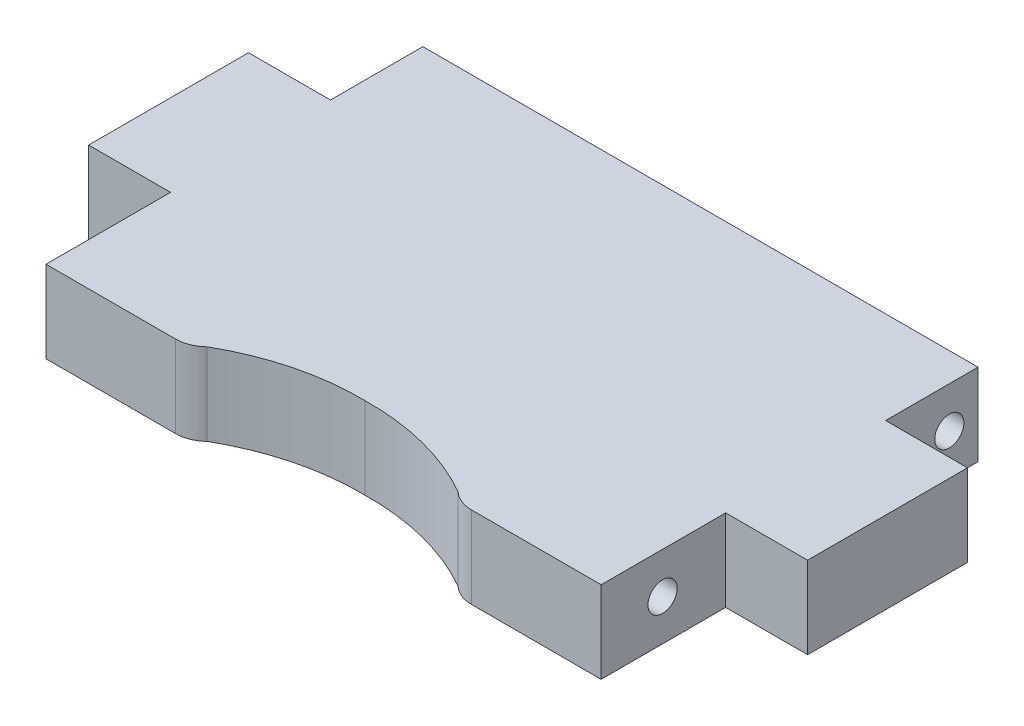
ISO-10303-21;
HEADER;
FILE_DESCRIPTION(('STEP AP214'),'2;1');
FILE_NAME('part.step','',(''),(''),'','','');
FILE_SCHEMA(('AUTOMOTIVE_DESIGN { 1 0 10303 214 1 1 1 1 }'));
ENDSEC;
DATA;
#1=APPLICATION_CONTEXT('core data for automotive mechanical design processes');
#2=APPLICATION_PROTOCOL_DEFINITION('international standard','automotive_design',2000,#1);
#3=PRODUCT_CONTEXT('',#1,'mechanical');
#4=PRODUCT('Part','Part','',(#3));
#5=PRODUCT_RELATED_PRODUCT_CATEGORY('part','',(#4));
#6=PRODUCT_DEFINITION_FORMATION('','',#4);
#7=PRODUCT_DEFINITION_CONTEXT('part definition',#1,'design');
#8=PRODUCT_DEFINITION('design','',#6,#7);
#9=PRODUCT_DEFINITION_SHAPE('','',#8);
#10=(LENGTH_UNIT() NAMED_UNIT(*) SI_UNIT(.MILLI.,.METRE.));
#11=(NAMED_UNIT(*) PLANE_ANGLE_UNIT() SI_UNIT($,.RADIAN.));
#12=(NAMED_UNIT(*) SI_UNIT($,.STERADIAN.) SOLID_ANGLE_UNIT());
#13=UNCERTAINTY_MEASURE_WITH_UNIT(LENGTH_MEASURE(1.E-05),#10,'distance_accuracy_value','');
#14=(GEOMETRIC_REPRESENTATION_CONTEXT(3) GLOBAL_UNCERTAINTY_ASSIGNED_CONTEXT((#13)) GLOBAL_UNIT_ASSIGNED_CONTEXT((#10,
#11,#12)) REPRESENTATION_CONTEXT('',''));
#15=CARTESIAN_POINT('',(0.,0.,0.));
#16=DIRECTION('',(0.,0.,1.));
#17=DIRECTION('',(1.,0.,0.));
#18=AXIS2_PLACEMENT_3D('',#15,#16,#17);
#19=CARTESIAN_POINT('',(21.5138,6.35,6.22300000000001));
#20=DIRECTION('',(-1.,0.,0.));
#21=DIRECTION('',(0.,0.,1.));
#22=AXIS2_PLACEMENT_3D('',#19,#20,#21);
#23=PLANE('',#22);
#24=DIRECTION('',(0.,0.,-1.));
#25=VECTOR('',#24,1.);
#26=CARTESIAN_POINT('',(21.5138,0.,6.22300000000001));
#27=LINE('',#26,#25);
#28=CARTESIAN_POINT('',(21.5138,0.,15.875));
#29=VERTEX_POINT('',#28);
#30=CARTESIAN_POINT('',(21.5138,0.,6.22300000000001));
#31=VERTEX_POINT('',#30);
#32=EDGE_CURVE('E247',#29,#31,#27,.T.);
#33=ORIENTED_EDGE('',*,*,#32,.T.);
#34=DIRECTION('',(0.,-1.,0.));
#35=VECTOR('',#34,1.);
#36=CARTESIAN_POINT('',(21.5138,6.35,6.22300000000001));
#37=LINE('',#36,#35);
#38=CARTESIAN_POINT('',(21.5138,6.35,6.22300000000001));
#39=VERTEX_POINT('',#38);
#40=EDGE_CURVE('E186',#39,#31,#37,.T.);
#41=ORIENTED_EDGE('',*,*,#40,.F.);
#42=DIRECTION('',(0.,0.,-1.));
#43=VECTOR('',#42,1.);
#44=CARTESIAN_POINT('',(21.5138,6.35,6.22300000000001));
#45=LINE('',#44,#43);
#46=CARTESIAN_POINT('',(21.5138,6.35,15.875));
#47=VERTEX_POINT('',#46);
#48=EDGE_CURVE('E276',#47,#39,#45,.T.);
#49=ORIENTED_EDGE('',*,*,#48,.F.);
#50=DIRECTION('',(0.,-1.,0.));
#51=VECTOR('',#50,1.);
#52=CARTESIAN_POINT('',(21.5138,6.35,15.875));
#53=LINE('',#52,#51);
#54=EDGE_CURVE('E172',#47,#29,#53,.T.);
#55=ORIENTED_EDGE('',*,*,#54,.T.);
#56=EDGE_LOOP('',(#33,#41,#49,#55));
#57=FACE_BOUND('',#56,.T.);
#58=CARTESIAN_POINT('',(21.5138,3.175,11.1125));
#59=DIRECTION('',(-1.,0.,0.));
#60=DIRECTION('',(0.,0.,-1.));
#61=AXIS2_PLACEMENT_3D('',#58,#59,#60);
#62=CIRCLE('',#61,1.1303);
#63=CARTESIAN_POINT('',(21.5138,3.175,9.98220000000004));
#64=VERTEX_POINT('',#63);
#65=EDGE_CURVE('E297',#64,#64,#62,.T.);
#66=ORIENTED_EDGE('',*,*,#65,.T.);
#67=EDGE_LOOP('',(#66));
#68=FACE_BOUND('',#67,.T.);
#69=ADVANCED_FACE('F33',(#57,#68),#23,.F.);
#70=CARTESIAN_POINT('',(21.5138,6.35,-13.3349999999999));
#71=DIRECTION('',(-1.,0.,0.));
#72=DIRECTION('',(0.,0.,1.));
#73=AXIS2_PLACEMENT_3D('',#70,#71,#72);
#74=PLANE('',#73);
#75=DIRECTION('',(0.,0.,-1.));
#76=VECTOR('',#75,1.);
#77=CARTESIAN_POINT('',(21.5138,0.,-13.3349999999999));
#78=LINE('',#77,#76);
#79=CARTESIAN_POINT('',(21.5138,0.,-6.17219999999999));
#80=VERTEX_POINT('',#79);
#81=CARTESIAN_POINT('',(21.5138,0.,-13.3349999999999));
#82=VERTEX_POINT('',#81);
#83=EDGE_CURVE('E239',#80,#82,#78,.T.);
#84=ORIENTED_EDGE('',*,*,#83,.T.);
#85=DIRECTION('',(0.,-1.,0.));
#86=VECTOR('',#85,1.);
#87=CARTESIAN_POINT('',(21.5138,6.35,-13.3349999999999));
#88=LINE('',#87,#86);
#89=CARTESIAN_POINT('',(21.5138,6.35,-13.3349999999999));
#90=VERTEX_POINT('',#89);
#91=EDGE_CURVE('E198',#90,#82,#88,.T.);
#92=ORIENTED_EDGE('',*,*,#91,.F.);
#93=DIRECTION('',(0.,0.,-1.));
#94=VECTOR('',#93,1.);
#95=CARTESIAN_POINT('',(21.5138,6.35,-13.3349999999999));
#96=LINE('',#95,#94);
#97=CARTESIAN_POINT('',(21.5138,6.35,-6.17219999999999));
#98=VERTEX_POINT('',#97);
#99=EDGE_CURVE('E268',#98,#90,#96,.T.);
#100=ORIENTED_EDGE('',*,*,#99,.F.);
#101=DIRECTION('',(0.,-1.,0.));
#102=VECTOR('',#101,1.);
#103=CARTESIAN_POINT('',(21.5138,6.35,-6.17219999999999));
#104=LINE('',#103,#102);
#105=EDGE_CURVE('E195',#98,#80,#104,.T.);
#106=ORIENTED_EDGE('',*,*,#105,.T.);
#107=EDGE_LOOP('',(#84,#92,#100,#106));
#108=FACE_BOUND('',#107,.T.);
#109=CARTESIAN_POINT('',(21.5138,3.175,-11.1125));
#110=DIRECTION('',(-1.,0.,0.));
#111=DIRECTION('',(0.,0.,1.));
#112=AXIS2_PLACEMENT_3D('',#109,#110,#111);
#113=CIRCLE('',#112,1.1303);
#114=CARTESIAN_POINT('',(21.5138,3.175,-9.9822));
#115=VERTEX_POINT('',#114);
#116=EDGE_CURVE('E291',#115,#115,#113,.T.);
#117=ORIENTED_EDGE('',*,*,#116,.T.);
#118=EDGE_LOOP('',(#117));
#119=FACE_BOUND('',#118,.T.);
#120=ADVANCED_FACE('F316',(#108,#119),#74,.F.);
#121=CARTESIAN_POINT('',(0.326891457855017,6.35,31.5256615416297));
#122=DIRECTION('',(0.,-1.,0.));
#123=DIRECTION('',(0.,0.,-1.));
#124=AXIS2_PLACEMENT_3D('',#121,#122,#123);
#125=CYLINDRICAL_SURFACE('',#124,18.8600533877145);
#126=CARTESIAN_POINT('',(0.326891457855017,0.,31.5256615416297));
#127=DIRECTION('',(0.,-1.,0.));
#128=DIRECTION('',(0.,0.,-1.));
#129=AXIS2_PLACEMENT_3D('',#126,#127,#128);
#130=CIRCLE('',#129,18.8600533877145);
#131=CARTESIAN_POINT('',(0.,0.,12.6684412861884));
#132=VERTEX_POINT('',#131);
#133=CARTESIAN_POINT('',(9.729950233897,0.,15.1768359128042));
#134=VERTEX_POINT('',#133);
#135=EDGE_CURVE('E169',#132,#134,#130,.T.);
#136=ORIENTED_EDGE('',*,*,#135,.T.);
#137=DIRECTION('',(0.,-1.,0.));
#138=VECTOR('',#137,1.);
#139=CARTESIAN_POINT('',(9.729950233897,6.35,15.1768359128042));
#140=LINE('',#139,#138);
#141=CARTESIAN_POINT('',(9.729950233897,6.35,15.1768359128042));
#142=VERTEX_POINT('',#141);
#143=EDGE_CURVE('E166',#142,#134,#140,.T.);
#144=ORIENTED_EDGE('',*,*,#143,.F.);
#145=CARTESIAN_POINT('',(0.326891457855017,6.35,31.5256615416297));
#146=DIRECTION('',(0.,-1.,0.));
#147=DIRECTION('',(0.,0.,-1.));
#148=AXIS2_PLACEMENT_3D('',#145,#146,#147);
#149=CIRCLE('',#148,18.8600533877145);
#150=CARTESIAN_POINT('',(0.,6.35,12.6684412861884));
#151=VERTEX_POINT('',#150);
#152=EDGE_CURVE('E151',#151,#142,#149,.T.);
#153=ORIENTED_EDGE('',*,*,#152,.F.);
#154=DIRECTION('',(0.,-1.,0.));
#155=VECTOR('',#154,1.);
#156=CARTESIAN_POINT('',(0.,6.35,12.6684412861884));
#157=LINE('',#156,#155);
#158=EDGE_CURVE('E222',#151,#132,#157,.T.);
#159=ORIENTED_EDGE('',*,*,#158,.T.);
#160=EDGE_LOOP('',(#136,#144,#153,#159));
#161=FACE_BOUND('',#160,.T.);
#162=ADVANCED_FACE('F167',(#161),#125,.F.);
#163=CARTESIAN_POINT('',(9.729950233897,6.35,15.875));
#164=DIRECTION('',(0.,0.,-1.));
#165=DIRECTION('',(-1.,0.,0.));
#166=AXIS2_PLACEMENT_3D('',#163,#164,#165);
#167=PLANE('',#166);
#168=DIRECTION('',(1.,0.,0.));
#169=VECTOR('',#168,1.);
#170=CARTESIAN_POINT('',(9.729950233897,6.35,15.875));
#171=LINE('',#170,#169);
#172=CARTESIAN_POINT('',(11.4790186917639,6.35,15.875));
#173=VERTEX_POINT('',#172);
#174=EDGE_CURVE('E161',#173,#47,#171,.T.);
#175=ORIENTED_EDGE('',*,*,#174,.F.);
#176=DIRECTION('',(0.,-1.,0.));
#177=VECTOR('',#176,1.);
#178=CARTESIAN_POINT('',(11.4790186917639,6.35,15.875));
#179=LINE('',#178,#177);
#180=CARTESIAN_POINT('',(11.4790186917639,0.,15.875));
#181=VERTEX_POINT('',#180);
#182=EDGE_CURVE('E171',#173,#181,#179,.T.);
#183=ORIENTED_EDGE('',*,*,#182,.T.);
#184=DIRECTION('',(1.,0.,0.));
#185=VECTOR('',#184,1.);
#186=CARTESIAN_POINT('',(9.729950233897,0.,15.875));
#187=LINE('',#186,#185);
#188=EDGE_CURVE('E249',#181,#29,#187,.T.);
#189=ORIENTED_EDGE('',*,*,#188,.T.);
#190=ORIENTED_EDGE('',*,*,#54,.F.);
#191=EDGE_LOOP('',(#175,#183,#189,#190));
#192=FACE_BOUND('',#191,.T.);
#193=ADVANCED_FACE('F329',(#192),#167,.F.);
#194=CARTESIAN_POINT('',(21.5138,6.35,6.22300000000001));
#195=DIRECTION('',(0.,0.,-1.));
#196=DIRECTION('',(-1.,0.,0.));
#197=AXIS2_PLACEMENT_3D('',#194,#195,#196);
#198=PLANE('',#197);
#199=DIRECTION('',(1.,0.,0.));
#200=VECTOR('',#199,1.);
#201=CARTESIAN_POINT('',(21.5138,0.,6.22300000000001));
#202=LINE('',#201,#200);
#203=CARTESIAN_POINT('',(27.8638,0.,6.22300000000001));
#204=VERTEX_POINT('',#203);
#205=EDGE_CURVE('E245',#31,#204,#202,.T.);
#206=ORIENTED_EDGE('',*,*,#205,.T.);
#207=DIRECTION('',(0.,-1.,0.));
#208=VECTOR('',#207,1.);
#209=CARTESIAN_POINT('',(27.8638,6.35,6.22300000000001));
#210=LINE('',#209,#208);
#211=CARTESIAN_POINT('',(27.8638,6.35,6.22300000000001));
#212=VERTEX_POINT('',#211);
#213=EDGE_CURVE('E189',#212,#204,#210,.T.);
#214=ORIENTED_EDGE('',*,*,#213,.F.);
#215=DIRECTION('',(1.,0.,0.));
#216=VECTOR('',#215,1.);
#217=CARTESIAN_POINT('',(21.5138,6.35,6.22300000000001));
#218=LINE('',#217,#216);
#219=EDGE_CURVE('E274',#39,#212,#218,.T.);
#220=ORIENTED_EDGE('',*,*,#219,.F.);
#221=ORIENTED_EDGE('',*,*,#40,.T.);
#222=EDGE_LOOP('',(#206,#214,#220,#221));
#223=FACE_BOUND('',#222,.T.);
#224=ADVANCED_FACE('F327',(#223),#198,.F.);
#225=CARTESIAN_POINT('',(27.8638,6.35,-6.17219999999999));
#226=DIRECTION('',(-1.,0.,0.));
#227=DIRECTION('',(0.,0.,1.));
#228=AXIS2_PLACEMENT_3D('',#225,#226,#227);
#229=PLANE('',#228);
#230=DIRECTION('',(0.,0.,-1.));
#231=VECTOR('',#230,1.);
#232=CARTESIAN_POINT('',(27.8638,0.,-6.17219999999999));
#233=LINE('',#232,#231);
#234=CARTESIAN_POINT('',(27.8638,0.,-6.17219999999999));
#235=VERTEX_POINT('',#234);
#236=EDGE_CURVE('E243',#204,#235,#233,.T.);
#237=ORIENTED_EDGE('',*,*,#236,.T.);
#238=DIRECTION('',(0.,-1.,0.));
#239=VECTOR('',#238,1.);
#240=CARTESIAN_POINT('',(27.8638,6.35,-6.17219999999999));
#241=LINE('',#240,#239);
#242=CARTESIAN_POINT('',(27.8638,6.35,-6.17219999999999));
#243=VERTEX_POINT('',#242);
#244=EDGE_CURVE('E192',#243,#235,#241,.T.);
#245=ORIENTED_EDGE('',*,*,#244,.F.);
#246=DIRECTION('',(0.,0.,-1.));
#247=VECTOR('',#246,1.);
#248=CARTESIAN_POINT('',(27.8638,6.35,-6.17219999999999));
#249=LINE('',#248,#247);
#250=EDGE_CURVE('E272',#212,#243,#249,.T.);
#251=ORIENTED_EDGE('',*,*,#250,.F.);
#252=ORIENTED_EDGE('',*,*,#213,.T.);
#253=EDGE_LOOP('',(#237,#245,#251,#252));
#254=FACE_BOUND('',#253,.T.);
#255=ADVANCED_FACE('F349',(#254),#229,.F.);
#256=CARTESIAN_POINT('',(21.5138,6.35,-6.17219999999999));
#257=DIRECTION('',(0.,0.,1.));
#258=DIRECTION('',(1.,0.,0.));
#259=AXIS2_PLACEMENT_3D('',#256,#257,#258);
#260=PLANE('',#259);
#261=DIRECTION('',(-1.,0.,0.));
#262=VECTOR('',#261,1.);
#263=CARTESIAN_POINT('',(21.5138,0.,-6.17219999999999));
#264=LINE('',#263,#262);
#265=EDGE_CURVE('E241',#235,#80,#264,.T.);
#266=ORIENTED_EDGE('',*,*,#265,.T.);
#267=ORIENTED_EDGE('',*,*,#105,.F.);
#268=DIRECTION('',(-1.,0.,0.));
#269=VECTOR('',#268,1.);
#270=CARTESIAN_POINT('',(21.5138,6.35,-6.17219999999999));
#271=LINE('',#270,#269);
#272=EDGE_CURVE('E270',#243,#98,#271,.T.);
#273=ORIENTED_EDGE('',*,*,#272,.F.);
#274=ORIENTED_EDGE('',*,*,#244,.T.);
#275=EDGE_LOOP('',(#266,#267,#273,#274));
#276=FACE_BOUND('',#275,.T.);
#277=ADVANCED_FACE('F356',(#276),#260,.F.);
#278=CARTESIAN_POINT('',(-21.5138,6.35,-13.3349999999999));
#279=DIRECTION('',(0.,0.,1.));
#280=DIRECTION('',(1.,0.,0.));
#281=AXIS2_PLACEMENT_3D('',#278,#279,#280);
#282=PLANE('',#281);
#283=DIRECTION('',(-1.,0.,0.));
#284=VECTOR('',#283,1.);
#285=CARTESIAN_POINT('',(-21.5138,0.,-13.3349999999999));
#286=LINE('',#285,#284);
#287=CARTESIAN_POINT('',(-21.5138,0.,-13.3349999999999));
#288=VERTEX_POINT('',#287);
#289=EDGE_CURVE('E237',#82,#288,#286,.T.);
#290=ORIENTED_EDGE('',*,*,#289,.T.);
#291=DIRECTION('',(0.,-1.,0.));
#292=VECTOR('',#291,1.);
#293=CARTESIAN_POINT('',(-21.5138,6.35,-13.3349999999999));
#294=LINE('',#293,#292);
#295=CARTESIAN_POINT('',(-21.5138,6.35,-13.3349999999999));
#296=VERTEX_POINT('',#295);
#297=EDGE_CURVE('E201',#296,#288,#294,.T.);
#298=ORIENTED_EDGE('',*,*,#297,.F.);
#299=DIRECTION('',(-1.,0.,0.));
#300=VECTOR('',#299,1.);
#301=CARTESIAN_POINT('',(-21.5138,6.35,-13.3349999999999));
#302=LINE('',#301,#300);
#303=EDGE_CURVE('E266',#90,#296,#302,.T.);
#304=ORIENTED_EDGE('',*,*,#303,.F.);
#305=ORIENTED_EDGE('',*,*,#91,.T.);
#306=EDGE_LOOP('',(#290,#298,#304,#305));
#307=FACE_BOUND('',#306,.T.);
#308=ADVANCED_FACE('F363',(#307),#282,.F.);
#309=CARTESIAN_POINT('',(-21.5138,6.35,-13.3349999999999));
#310=DIRECTION('',(1.,0.,0.));
#311=DIRECTION('',(0.,0.,-1.));
#312=AXIS2_PLACEMENT_3D('',#309,#310,#311);
#313=PLANE('',#312);
#314=CARTESIAN_POINT('',(-21.5138,3.175,-11.1125));
#315=DIRECTION('',(-1.,0.,0.));
#316=DIRECTION('',(0.,0.,1.));
#317=AXIS2_PLACEMENT_3D('',#314,#315,#316);
#318=CIRCLE('',#317,1.1303);
#319=CARTESIAN_POINT('',(-21.5138,3.175,-9.9822));
#320=VERTEX_POINT('',#319);
#321=EDGE_CURVE('E279',#320,#320,#318,.T.);
#322=ORIENTED_EDGE('',*,*,#321,.F.);
#323=EDGE_LOOP('',(#322));
#324=FACE_BOUND('',#323,.T.);
#325=DIRECTION('',(0.,0.,1.));
#326=VECTOR('',#325,1.);
#327=CARTESIAN_POINT('',(-21.5138,0.,-13.3349999999999));
#328=LINE('',#327,#326);
#329=CARTESIAN_POINT('',(-21.5138,0.,-6.17219999999996));
#330=VERTEX_POINT('',#329);
#331=EDGE_CURVE('E235',#288,#330,#328,.T.);
#332=ORIENTED_EDGE('',*,*,#331,.T.);
#333=DIRECTION('',(0.,-1.,0.));
#334=VECTOR('',#333,1.);
#335=CARTESIAN_POINT('',(-21.5138,6.35,-6.17219999999996));
#336=LINE('',#335,#334);
#337=CARTESIAN_POINT('',(-21.5138,6.35,-6.17219999999996));
#338=VERTEX_POINT('',#337);
#339=EDGE_CURVE('E204',#338,#330,#336,.T.);
#340=ORIENTED_EDGE('',*,*,#339,.F.);
#341=DIRECTION('',(0.,0.,1.));
#342=VECTOR('',#341,1.);
#343=CARTESIAN_POINT('',(-21.5138,6.35,-13.3349999999999));
#344=LINE('',#343,#342);
#345=EDGE_CURVE('E264',#296,#338,#344,.T.);
#346=ORIENTED_EDGE('',*,*,#345,.F.);
#347=ORIENTED_EDGE('',*,*,#297,.T.);
#348=EDGE_LOOP('',(#332,#340,#346,#347));
#349=FACE_BOUND('',#348,.T.);
#350=ADVANCED_FACE('F371',(#324,#349),#313,.F.);
#351=CARTESIAN_POINT('',(-21.5138,6.35,-6.17219999999996));
#352=DIRECTION('',(0.,0.,1.));
#353=DIRECTION('',(1.,0.,0.));
#354=AXIS2_PLACEMENT_3D('',#351,#352,#353);
#355=PLANE('',#354);
#356=DIRECTION('',(-1.,0.,0.));
#357=VECTOR('',#356,1.);
#358=CARTESIAN_POINT('',(-21.5138,0.,-6.17219999999996));
#359=LINE('',#358,#357);
#360=CARTESIAN_POINT('',(-27.8638,0.,-6.17219999999996));
#361=VERTEX_POINT('',#360);
#362=EDGE_CURVE('E233',#330,#361,#359,.T.);
#363=ORIENTED_EDGE('',*,*,#362,.T.);
#364=DIRECTION('',(0.,-1.,0.));
#365=VECTOR('',#364,1.);
#366=CARTESIAN_POINT('',(-27.8638,6.35,-6.17219999999996));
#367=LINE('',#366,#365);
#368=CARTESIAN_POINT('',(-27.8638,6.35,-6.17219999999996));
#369=VERTEX_POINT('',#368);
#370=EDGE_CURVE('E207',#369,#361,#367,.T.);
#371=ORIENTED_EDGE('',*,*,#370,.F.);
#372=DIRECTION('',(-1.,0.,0.));
#373=VECTOR('',#372,1.);
#374=CARTESIAN_POINT('',(-21.5138,6.35,-6.17219999999996));
#375=LINE('',#374,#373);
#376=EDGE_CURVE('E262',#338,#369,#375,.T.);
#377=ORIENTED_EDGE('',*,*,#376,.F.);
#378=ORIENTED_EDGE('',*,*,#339,.T.);
#379=EDGE_LOOP('',(#363,#371,#377,#378));
#380=FACE_BOUND('',#379,.T.);
#381=ADVANCED_FACE('F380',(#380),#355,.F.);
#382=CARTESIAN_POINT('',(-27.8638,6.35,-6.17219999999996));
#383=DIRECTION('',(1.,0.,0.));
#384=DIRECTION('',(0.,0.,-1.));
#385=AXIS2_PLACEMENT_3D('',#382,#383,#384);
#386=PLANE('',#385);
#387=DIRECTION('',(0.,0.,1.));
#388=VECTOR('',#387,1.);
#389=CARTESIAN_POINT('',(-27.8638,0.,-6.17219999999996));
#390=LINE('',#389,#388);
#391=CARTESIAN_POINT('',(-27.8638,0.,6.22300000000001));
#392=VERTEX_POINT('',#391);
#393=EDGE_CURVE('E231',#361,#392,#390,.T.);
#394=ORIENTED_EDGE('',*,*,#393,.T.);
#395=DIRECTION('',(0.,-1.,0.));
#396=VECTOR('',#395,1.);
#397=CARTESIAN_POINT('',(-27.8638,6.35,6.22300000000001));
#398=LINE('',#397,#396);
#399=CARTESIAN_POINT('',(-27.8638,6.35,6.22300000000001));
#400=VERTEX_POINT('',#399);
#401=EDGE_CURVE('E210',#400,#392,#398,.T.);
#402=ORIENTED_EDGE('',*,*,#401,.F.);
#403=DIRECTION('',(0.,0.,1.));
#404=VECTOR('',#403,1.);
#405=CARTESIAN_POINT('',(-27.8638,6.35,-6.17219999999996));
#406=LINE('',#405,#404);
#407=EDGE_CURVE('E260',#369,#400,#406,.T.);
#408=ORIENTED_EDGE('',*,*,#407,.F.);
#409=ORIENTED_EDGE('',*,*,#370,.T.);
#410=EDGE_LOOP('',(#394,#402,#408,#409));
#411=FACE_BOUND('',#410,.T.);
#412=ADVANCED_FACE('F389',(#411),#386,.F.);
#413=CARTESIAN_POINT('',(-21.5138,6.35,6.22300000000001));
#414=DIRECTION('',(0.,0.,-1.));
#415=DIRECTION('',(-1.,0.,0.));
#416=AXIS2_PLACEMENT_3D('',#413,#414,#415);
#417=PLANE('',#416);
#418=DIRECTION('',(1.,0.,0.));
#419=VECTOR('',#418,1.);
#420=CARTESIAN_POINT('',(-21.5138,0.,6.22300000000001));
#421=LINE('',#420,#419);
#422=CARTESIAN_POINT('',(-21.5138,0.,6.22300000000001));
#423=VERTEX_POINT('',#422);
#424=EDGE_CURVE('E229',#392,#423,#421,.T.);
#425=ORIENTED_EDGE('',*,*,#424,.T.);
#426=DIRECTION('',(0.,-1.,0.));
#427=VECTOR('',#426,1.);
#428=CARTESIAN_POINT('',(-21.5138,6.35,6.22300000000001));
#429=LINE('',#428,#427);
#430=CARTESIAN_POINT('',(-21.5138,6.35,6.22300000000001));
#431=VERTEX_POINT('',#430);
#432=EDGE_CURVE('E213',#431,#423,#429,.T.);
#433=ORIENTED_EDGE('',*,*,#432,.F.);
#434=DIRECTION('',(1.,0.,0.));
#435=VECTOR('',#434,1.);
#436=CARTESIAN_POINT('',(-21.5138,6.35,6.22300000000001));
#437=LINE('',#436,#435);
#438=EDGE_CURVE('E258',#400,#431,#437,.T.);
#439=ORIENTED_EDGE('',*,*,#438,.F.);
#440=ORIENTED_EDGE('',*,*,#401,.T.);
#441=EDGE_LOOP('',(#425,#433,#439,#440));
#442=FACE_BOUND('',#441,.T.);
#443=ADVANCED_FACE('F397',(#442),#417,.F.);
#444=CARTESIAN_POINT('',(-21.5138,6.35,15.875));
#445=DIRECTION('',(1.,0.,0.));
#446=DIRECTION('',(0.,0.,-1.));
#447=AXIS2_PLACEMENT_3D('',#444,#445,#446);
#448=PLANE('',#447);
#449=CARTESIAN_POINT('',(-21.5138,3.175,11.1125));
#450=DIRECTION('',(-1.,0.,0.));
#451=DIRECTION('',(0.,0.,-1.));
#452=AXIS2_PLACEMENT_3D('',#449,#450,#451);
#453=CIRCLE('',#452,1.1303);
#454=CARTESIAN_POINT('',(-21.5138,3.175,9.98220000000004));
#455=VERTEX_POINT('',#454);
#456=EDGE_CURVE('E285',#455,#455,#453,.T.);
#457=ORIENTED_EDGE('',*,*,#456,.F.);
#458=EDGE_LOOP('',(#457));
#459=FACE_BOUND('',#458,.T.);
#460=DIRECTION('',(0.,0.,1.));
#461=VECTOR('',#460,1.);
#462=CARTESIAN_POINT('',(-21.5138,0.,15.875));
#463=LINE('',#462,#461);
#464=CARTESIAN_POINT('',(-21.5138,0.,15.875));
#465=VERTEX_POINT('',#464);
#466=EDGE_CURVE('E227',#423,#465,#463,.T.);
#467=ORIENTED_EDGE('',*,*,#466,.T.);
#468=DIRECTION('',(0.,-1.,0.));
#469=VECTOR('',#468,1.);
#470=CARTESIAN_POINT('',(-21.5138,6.35,15.875));
#471=LINE('',#470,#469);
#472=CARTESIAN_POINT('',(-21.5138,6.35,15.875));
#473=VERTEX_POINT('',#472);
#474=EDGE_CURVE('E216',#473,#465,#471,.T.);
#475=ORIENTED_EDGE('',*,*,#474,.F.);
#476=DIRECTION('',(0.,0.,1.));
#477=VECTOR('',#476,1.);
#478=CARTESIAN_POINT('',(-21.5138,6.35,15.875));
#479=LINE('',#478,#477);
#480=EDGE_CURVE('E256',#431,#473,#479,.T.);
#481=ORIENTED_EDGE('',*,*,#480,.F.);
#482=ORIENTED_EDGE('',*,*,#432,.T.);
#483=EDGE_LOOP('',(#467,#475,#481,#482));
#484=FACE_BOUND('',#483,.T.);
#485=ADVANCED_FACE('F404',(#459,#484),#448,.F.);
#486=CARTESIAN_POINT('',(-21.5138,6.35,15.875));
#487=DIRECTION('',(0.,0.,-1.));
#488=DIRECTION('',(-1.,0.,0.));
#489=AXIS2_PLACEMENT_3D('',#486,#487,#488);
#490=PLANE('',#489);
#491=DIRECTION('',(1.,0.,0.));
#492=VECTOR('',#491,1.);
#493=CARTESIAN_POINT('',(-21.5138,0.,15.875));
#494=LINE('',#493,#492);
#495=CARTESIAN_POINT('',(-11.4790186917639,0.,15.875));
#496=VERTEX_POINT('',#495);
#497=EDGE_CURVE('E225',#465,#496,#494,.T.);
#498=ORIENTED_EDGE('',*,*,#497,.T.);
#499=DIRECTION('',(0.,-1.,0.));
#500=VECTOR('',#499,1.);
#501=CARTESIAN_POINT('',(-11.4790186917639,6.35,15.875));
#502=LINE('',#501,#500);
#503=CARTESIAN_POINT('',(-11.4790186917639,6.35,15.875));
#504=VERTEX_POINT('',#503);
#505=EDGE_CURVE('E11',#496,#504,#502,.F.);
#506=ORIENTED_EDGE('',*,*,#505,.T.);
#507=DIRECTION('',(1.,0.,0.));
#508=VECTOR('',#507,1.);
#509=CARTESIAN_POINT('',(-21.5138,6.35,15.875));
#510=LINE('',#509,#508);
#511=EDGE_CURVE('E254',#473,#504,#510,.T.);
#512=ORIENTED_EDGE('',*,*,#511,.F.);
#513=ORIENTED_EDGE('',*,*,#474,.T.);
#514=EDGE_LOOP('',(#498,#506,#512,#513));
#515=FACE_BOUND('',#514,.T.);
#516=ADVANCED_FACE('F411',(#515),#490,.F.);
#517=CARTESIAN_POINT('',(-0.326891457855024,6.35,31.5256615416297));
#518=DIRECTION('',(0.,-1.,0.));
#519=DIRECTION('',(0.,0.,-1.));
#520=AXIS2_PLACEMENT_3D('',#517,#518,#519);
#521=CYLINDRICAL_SURFACE('',#520,18.8600533877145);
#522=CARTESIAN_POINT('',(-0.326891457855024,0.,31.5256615416297));
#523=DIRECTION('',(0.,-1.,0.));
#524=DIRECTION('',(0.,0.,1.));
#525=AXIS2_PLACEMENT_3D('',#522,#523,#524);
#526=CIRCLE('',#525,18.8600533877145);
#527=CARTESIAN_POINT('',(-9.729950233897,0.,15.1768359128042));
#528=VERTEX_POINT('',#527);
#529=EDGE_CURVE('E162',#528,#132,#526,.T.);
#530=ORIENTED_EDGE('',*,*,#529,.T.);
#531=ORIENTED_EDGE('',*,*,#158,.F.);
#532=CARTESIAN_POINT('',(-0.326891457855024,6.35,31.5256615416297));
#533=DIRECTION('',(0.,-1.,0.));
#534=DIRECTION('',(0.,0.,1.));
#535=AXIS2_PLACEMENT_3D('',#532,#533,#534);
#536=CIRCLE('',#535,18.8600533877145);
#537=CARTESIAN_POINT('',(-9.729950233897,6.35,15.1768359128042));
#538=VERTEX_POINT('',#537);
#539=EDGE_CURVE('E157',#538,#151,#536,.T.);
#540=ORIENTED_EDGE('',*,*,#539,.F.);
#541=DIRECTION('',(0.,-1.,0.));
#542=VECTOR('',#541,1.);
#543=CARTESIAN_POINT('',(-9.729950233897,6.35,15.1768359128042));
#544=LINE('',#543,#542);
#545=EDGE_CURVE('E219',#538,#528,#544,.T.);
#546=ORIENTED_EDGE('',*,*,#545,.T.);
#547=EDGE_LOOP('',(#530,#531,#540,#546));
#548=FACE_BOUND('',#547,.T.);
#549=ADVANCED_FACE('F419',(#548),#521,.F.);
#550=CARTESIAN_POINT('',(0.326891457855017,6.35,31.5256615416297));
#551=DIRECTION('',(0.,-1.,0.));
#552=DIRECTION('',(0.,0.,-1.));
#553=AXIS2_PLACEMENT_3D('',#550,#551,#552);
#554=PLANE('',#553);
#555=ORIENTED_EDGE('',*,*,#152,.T.);
#556=CARTESIAN_POINT('',(11.4790186917639,6.35,13.335));
#557=DIRECTION('',(0.,-1.,0.));
#558=DIRECTION('',(0.,0.,-1.));
#559=AXIS2_PLACEMENT_3D('',#556,#557,#558);
#560=CIRCLE('',#559,2.54);
#561=EDGE_CURVE('E41',#142,#173,#560,.F.);
#562=ORIENTED_EDGE('',*,*,#561,.T.);
#563=ORIENTED_EDGE('',*,*,#174,.T.);
#564=ORIENTED_EDGE('',*,*,#48,.T.);
#565=ORIENTED_EDGE('',*,*,#219,.T.);
#566=ORIENTED_EDGE('',*,*,#250,.T.);
#567=ORIENTED_EDGE('',*,*,#272,.T.);
#568=ORIENTED_EDGE('',*,*,#99,.T.);
#569=ORIENTED_EDGE('',*,*,#303,.T.);
#570=ORIENTED_EDGE('',*,*,#345,.T.);
#571=ORIENTED_EDGE('',*,*,#376,.T.);
#572=ORIENTED_EDGE('',*,*,#407,.T.);
#573=ORIENTED_EDGE('',*,*,#438,.T.);
#574=ORIENTED_EDGE('',*,*,#480,.T.);
#575=ORIENTED_EDGE('',*,*,#511,.T.);
#576=CARTESIAN_POINT('',(-11.4790186917639,6.35,13.335));
#577=DIRECTION('',(0.,-1.,0.));
#578=DIRECTION('',(0.,0.,-1.));
#579=AXIS2_PLACEMENT_3D('',#576,#577,#578);
#580=CIRCLE('',#579,2.54);
#581=EDGE_CURVE('E177',#504,#538,#580,.F.);
#582=ORIENTED_EDGE('',*,*,#581,.T.);
#583=ORIENTED_EDGE('',*,*,#539,.T.);
#584=EDGE_LOOP('',(#555,#562,#563,#564,#565,#566,#567,#568,#569,#570,#571,#572,#573,#574,#575,
#582,#583));
#585=FACE_BOUND('',#584,.T.);
#586=ADVANCED_FACE('F153',(#585),#554,.F.);
#587=CARTESIAN_POINT('',(0.326891457855017,0.,31.5256615416297));
#588=DIRECTION('',(0.,-1.,0.));
#589=DIRECTION('',(0.,0.,-1.));
#590=AXIS2_PLACEMENT_3D('',#587,#588,#589);
#591=PLANE('',#590);
#592=ORIENTED_EDGE('',*,*,#188,.F.);
#593=CARTESIAN_POINT('',(11.4790186917639,0.,13.335));
#594=DIRECTION('',(0.,-1.,0.));
#595=DIRECTION('',(0.,0.,-1.));
#596=AXIS2_PLACEMENT_3D('',#593,#594,#595);
#597=CIRCLE('',#596,2.54);
#598=EDGE_CURVE('E178',#181,#134,#597,.T.);
#599=ORIENTED_EDGE('',*,*,#598,.T.);
#600=ORIENTED_EDGE('',*,*,#135,.F.);
#601=ORIENTED_EDGE('',*,*,#529,.F.);
#602=CARTESIAN_POINT('',(-11.4790186917639,0.,13.335));
#603=DIRECTION('',(0.,-1.,0.));
#604=DIRECTION('',(0.,0.,-1.));
#605=AXIS2_PLACEMENT_3D('',#602,#603,#604);
#606=CIRCLE('',#605,2.54);
#607=EDGE_CURVE('E54',#528,#496,#606,.T.);
#608=ORIENTED_EDGE('',*,*,#607,.T.);
#609=ORIENTED_EDGE('',*,*,#497,.F.);
#610=ORIENTED_EDGE('',*,*,#466,.F.);
#611=ORIENTED_EDGE('',*,*,#424,.F.);
#612=ORIENTED_EDGE('',*,*,#393,.F.);
#613=ORIENTED_EDGE('',*,*,#362,.F.);
#614=ORIENTED_EDGE('',*,*,#331,.F.);
#615=ORIENTED_EDGE('',*,*,#289,.F.);
#616=ORIENTED_EDGE('',*,*,#83,.F.);
#617=ORIENTED_EDGE('',*,*,#265,.F.);
#618=ORIENTED_EDGE('',*,*,#236,.F.);
#619=ORIENTED_EDGE('',*,*,#205,.F.);
#620=ORIENTED_EDGE('',*,*,#32,.F.);
#621=EDGE_LOOP('',(#592,#599,#600,#601,#608,#609,#610,#611,#612,#613,#614,#615,#616,#617,#618,
#619,#620));
#622=FACE_BOUND('',#621,.T.);
#623=ADVANCED_FACE('F433',(#622),#591,.T.);
#624=CARTESIAN_POINT('',(-8.81380000000002,3.175,-11.1125));
#625=DIRECTION('',(-1.,0.,0.));
#626=DIRECTION('',(0.,0.,1.));
#627=AXIS2_PLACEMENT_3D('',#624,#625,#626);
#628=CYLINDRICAL_SURFACE('',#627,1.1303);
#629=CARTESIAN_POINT('',(-8.81380000000002,3.175,-11.1125));
#630=DIRECTION('',(-1.,0.,0.));
#631=DIRECTION('',(0.,0.,1.));
#632=AXIS2_PLACEMENT_3D('',#629,#630,#631);
#633=CIRCLE('',#632,1.1303);
#634=CARTESIAN_POINT('',(-8.81380000000002,3.175,-9.98220000000001));
#635=VERTEX_POINT('',#634);
#636=EDGE_CURVE('E252',#635,#635,#633,.T.);
#637=ORIENTED_EDGE('',*,*,#636,.F.);
#638=EDGE_LOOP('',(#637));
#639=FACE_BOUND('',#638,.T.);
#640=ORIENTED_EDGE('',*,*,#321,.T.);
#641=EDGE_LOOP('',(#640));
#642=FACE_BOUND('',#641,.T.);
#643=ADVANCED_FACE('F440',(#639,#642),#628,.F.);
#644=CARTESIAN_POINT('',(-8.81380000000002,3.175,-11.1125));
#645=DIRECTION('',(-1.,0.,0.));
#646=DIRECTION('',(0.,0.,1.));
#647=AXIS2_PLACEMENT_3D('',#644,#645,#646);
#648=PLANE('',#647);
#649=ORIENTED_EDGE('',*,*,#636,.T.);
#650=EDGE_LOOP('',(#649));
#651=FACE_BOUND('',#650,.T.);
#652=ADVANCED_FACE('F447',(#651),#648,.T.);
#653=CARTESIAN_POINT('',(-8.8138,3.175,11.1125));
#654=DIRECTION('',(-1.,0.,0.));
#655=DIRECTION('',(0.,0.,1.));
#656=AXIS2_PLACEMENT_3D('',#653,#654,#655);
#657=CYLINDRICAL_SURFACE('',#656,1.1303);
#658=CARTESIAN_POINT('',(-8.8138,3.175,11.1125));
#659=DIRECTION('',(-1.,0.,0.));
#660=DIRECTION('',(0.,0.,-1.));
#661=AXIS2_PLACEMENT_3D('',#658,#659,#660);
#662=CIRCLE('',#661,1.1303);
#663=CARTESIAN_POINT('',(-8.81380000000001,3.175,9.98220000000003));
#664=VERTEX_POINT('',#663);
#665=EDGE_CURVE('E282',#664,#664,#662,.T.);
#666=ORIENTED_EDGE('',*,*,#665,.F.);
#667=EDGE_LOOP('',(#666));
#668=FACE_BOUND('',#667,.T.);
#669=ORIENTED_EDGE('',*,*,#456,.T.);
#670=EDGE_LOOP('',(#669));
#671=FACE_BOUND('',#670,.T.);
#672=ADVANCED_FACE('F455',(#668,#671),#657,.F.);
#673=CARTESIAN_POINT('',(-8.8138,3.175,11.1125));
#674=DIRECTION('',(1.,0.,0.));
#675=DIRECTION('',(0.,0.,-1.));
#676=AXIS2_PLACEMENT_3D('',#673,#674,#675);
#677=PLANE('',#676);
#678=ORIENTED_EDGE('',*,*,#665,.T.);
#679=EDGE_LOOP('',(#678));
#680=FACE_BOUND('',#679,.T.);
#681=ADVANCED_FACE('F463',(#680),#677,.F.);
#682=CARTESIAN_POINT('',(8.81380000000002,3.175,-11.1125));
#683=DIRECTION('',(1.,0.,0.));
#684=DIRECTION('',(0.,0.,-1.));
#685=AXIS2_PLACEMENT_3D('',#682,#683,#684);
#686=CYLINDRICAL_SURFACE('',#685,1.1303);
#687=CARTESIAN_POINT('',(8.81380000000002,3.175,-11.1125));
#688=DIRECTION('',(-1.,0.,0.));
#689=DIRECTION('',(0.,0.,1.));
#690=AXIS2_PLACEMENT_3D('',#687,#688,#689);
#691=CIRCLE('',#690,1.1303);
#692=CARTESIAN_POINT('',(8.81380000000002,3.175,-9.98220000000001));
#693=VERTEX_POINT('',#692);
#694=EDGE_CURVE('E288',#693,#693,#691,.T.);
#695=ORIENTED_EDGE('',*,*,#694,.T.);
#696=EDGE_LOOP('',(#695));
#697=FACE_BOUND('',#696,.T.);
#698=ORIENTED_EDGE('',*,*,#116,.F.);
#699=EDGE_LOOP('',(#698));
#700=FACE_BOUND('',#699,.T.);
#701=ADVANCED_FACE('F471',(#697,#700),#686,.F.);
#702=CARTESIAN_POINT('',(8.81380000000002,3.175,-11.1125));
#703=DIRECTION('',(1.,0.,0.));
#704=DIRECTION('',(0.,0.,1.));
#705=AXIS2_PLACEMENT_3D('',#702,#703,#704);
#706=PLANE('',#705);
#707=ORIENTED_EDGE('',*,*,#694,.F.);
#708=EDGE_LOOP('',(#707));
#709=FACE_BOUND('',#708,.T.);
#710=ADVANCED_FACE('F313',(#709),#706,.T.);
#711=CARTESIAN_POINT('',(8.8138,3.175,11.1125));
#712=DIRECTION('',(1.,0.,0.));
#713=DIRECTION('',(0.,0.,-1.));
#714=AXIS2_PLACEMENT_3D('',#711,#712,#713);
#715=CYLINDRICAL_SURFACE('',#714,1.1303);
#716=CARTESIAN_POINT('',(8.8138,3.175,11.1125));
#717=DIRECTION('',(-1.,0.,0.));
#718=DIRECTION('',(0.,0.,-1.));
#719=AXIS2_PLACEMENT_3D('',#716,#717,#718);
#720=CIRCLE('',#719,1.1303);
#721=CARTESIAN_POINT('',(8.81380000000001,3.175,9.98220000000003));
#722=VERTEX_POINT('',#721);
#723=EDGE_CURVE('E294',#722,#722,#720,.T.);
#724=ORIENTED_EDGE('',*,*,#723,.T.);
#725=EDGE_LOOP('',(#724));
#726=FACE_BOUND('',#725,.T.);
#727=ORIENTED_EDGE('',*,*,#65,.F.);
#728=EDGE_LOOP('',(#727));
#729=FACE_BOUND('',#728,.T.);
#730=ADVANCED_FACE('F303',(#726,#729),#715,.F.);
#731=CARTESIAN_POINT('',(8.8138,3.175,11.1125));
#732=DIRECTION('',(-1.,0.,0.));
#733=DIRECTION('',(0.,0.,-1.));
#734=AXIS2_PLACEMENT_3D('',#731,#732,#733);
#735=PLANE('',#734);
#736=ORIENTED_EDGE('',*,*,#723,.F.);
#737=EDGE_LOOP('',(#736));
#738=FACE_BOUND('',#737,.T.);
#739=ADVANCED_FACE('F306',(#738),#735,.F.);
#740=CARTESIAN_POINT('',(11.4790186917639,6.35,13.335));
#741=DIRECTION('',(0.,-1.,0.));
#742=DIRECTION('',(0.,0.,-1.));
#743=AXIS2_PLACEMENT_3D('',#740,#741,#742);
#744=CYLINDRICAL_SURFACE('',#743,2.54);
#745=ORIENTED_EDGE('',*,*,#561,.F.);
#746=ORIENTED_EDGE('',*,*,#143,.T.);
#747=ORIENTED_EDGE('',*,*,#598,.F.);
#748=ORIENTED_EDGE('',*,*,#182,.F.);
#749=EDGE_LOOP('',(#745,#746,#747,#748));
#750=FACE_BOUND('',#749,.T.);
#751=ADVANCED_FACE('F175',(#750),#744,.T.);
#752=CARTESIAN_POINT('',(-11.4790186917639,6.35,13.335));
#753=DIRECTION('',(0.,-1.,0.));
#754=DIRECTION('',(0.,0.,-1.));
#755=AXIS2_PLACEMENT_3D('',#752,#753,#754);
#756=CYLINDRICAL_SURFACE('',#755,2.54);
#757=ORIENTED_EDGE('',*,*,#581,.F.);
#758=ORIENTED_EDGE('',*,*,#505,.F.);
#759=ORIENTED_EDGE('',*,*,#607,.F.);
#760=ORIENTED_EDGE('',*,*,#545,.F.);
#761=EDGE_LOOP('',(#757,#758,#759,#760));
#762=FACE_BOUND('',#761,.T.);
#763=ADVANCED_FACE('F35',(#762),#756,.T.);
#764=CLOSED_SHELL('',(#69,#120,#162,#193,#224,#255,#277,#308,#350,#381,#412,#443,#485,#516,#549,
#586,#623,#643,#652,#672,#681,#701,#710,#730,#739,#751,#763));
#765=MANIFOLD_SOLID_BREP('B2',#764);
#766=ADVANCED_BREP_SHAPE_REPRESENTATION('',(#18,#765),#14);
#767=SHAPE_DEFINITION_REPRESENTATION(#9,#766);
ENDSEC;
END-ISO-10303-21;
